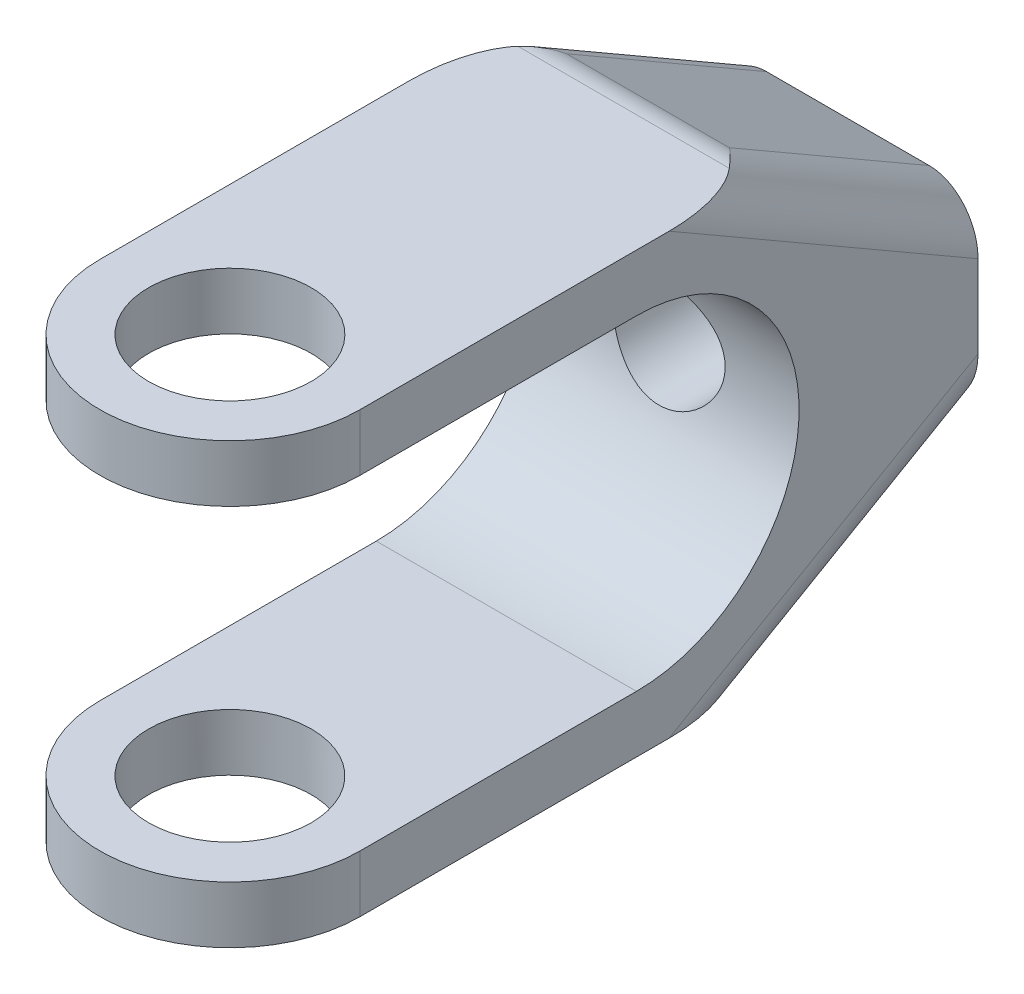
ISO-10303-21;
HEADER;
FILE_DESCRIPTION(('STEP AP214'),'2;1');
FILE_NAME('part.step','',(''),(''),'','','');
FILE_SCHEMA(('AUTOMOTIVE_DESIGN { 1 0 10303 214 1 1 1 1 }'));
ENDSEC;
DATA;
#1=APPLICATION_CONTEXT('core data for automotive mechanical design processes');
#2=APPLICATION_PROTOCOL_DEFINITION('international standard','automotive_design',2000,#1);
#3=PRODUCT_CONTEXT('',#1,'mechanical');
#4=PRODUCT('Part','Part','',(#3));
#5=PRODUCT_RELATED_PRODUCT_CATEGORY('part','',(#4));
#6=PRODUCT_DEFINITION_FORMATION('','',#4);
#7=PRODUCT_DEFINITION_CONTEXT('part definition',#1,'design');
#8=PRODUCT_DEFINITION('design','',#6,#7);
#9=PRODUCT_DEFINITION_SHAPE('','',#8);
#10=(LENGTH_UNIT() NAMED_UNIT(*) SI_UNIT(.MILLI.,.METRE.));
#11=(NAMED_UNIT(*) PLANE_ANGLE_UNIT() SI_UNIT($,.RADIAN.));
#12=(NAMED_UNIT(*) SI_UNIT($,.STERADIAN.) SOLID_ANGLE_UNIT());
#13=UNCERTAINTY_MEASURE_WITH_UNIT(LENGTH_MEASURE(1.E-05),#10,'distance_accuracy_value','');
#14=(GEOMETRIC_REPRESENTATION_CONTEXT(3) GLOBAL_UNCERTAINTY_ASSIGNED_CONTEXT((#13)) GLOBAL_UNIT_ASSIGNED_CONTEXT((#10,
#11,#12)) REPRESENTATION_CONTEXT('',''));
#15=CARTESIAN_POINT('',(0.,0.,0.));
#16=DIRECTION('',(0.,0.,1.));
#17=DIRECTION('',(1.,0.,0.));
#18=AXIS2_PLACEMENT_3D('',#15,#16,#17);
#19=CARTESIAN_POINT('',(-11.,13.5,60.));
#20=DIRECTION('',(0.,-1.,0.));
#21=DIRECTION('',(0.,0.,-1.));
#22=AXIS2_PLACEMENT_3D('',#19,#20,#21);
#23=PLANE('',#22);
#24=CARTESIAN_POINT('',(0.,13.5,38.));
#25=DIRECTION('',(0.,1.,0.));
#26=DIRECTION('',(0.,0.,1.));
#27=AXIS2_PLACEMENT_3D('',#24,#25,#26);
#28=CIRCLE('',#27,5.);
#29=CARTESIAN_POINT('',(0.,13.5,43.));
#30=VERTEX_POINT('',#29);
#31=EDGE_CURVE('E209',#30,#30,#28,.T.);
#32=ORIENTED_EDGE('',*,*,#31,.F.);
#33=EDGE_LOOP('',(#32));
#34=FACE_BOUND('',#33,.T.);
#35=DIRECTION('',(-1.,0.,0.));
#36=VECTOR('',#35,1.);
#37=CARTESIAN_POINT('',(-11.,13.5,13.7942286340599));
#38=LINE('',#37,#36);
#39=CARTESIAN_POINT('',(6.50000000000001,13.5,13.7942286340599));
#40=VERTEX_POINT('',#39);
#41=CARTESIAN_POINT('',(-6.5,13.5,13.7942286340599));
#42=VERTEX_POINT('',#41);
#43=EDGE_CURVE('E55',#40,#42,#38,.T.);
#44=ORIENTED_EDGE('',*,*,#43,.T.);
#45=CARTESIAN_POINT('',(-5.,13.5,18.9903810567665));
#46=DIRECTION('',(0.,-1.,0.));
#47=DIRECTION('',(0.,0.,-1.));
#48=AXIS2_PLACEMENT_3D('',#45,#46,#47);
#49=ELLIPSE('',#48,5.99999999999999,3.);
#50=CARTESIAN_POINT('',(-8.,13.5,18.9903810567665));
#51=VERTEX_POINT('',#50);
#52=EDGE_CURVE('E11',#42,#51,#49,.F.);
#53=ORIENTED_EDGE('',*,*,#52,.T.);
#54=DIRECTION('',(0.,0.,-1.));
#55=VECTOR('',#54,1.);
#56=CARTESIAN_POINT('',(-8.,13.5,38.));
#57=LINE('',#56,#55);
#58=CARTESIAN_POINT('',(-8.,13.5,38.));
#59=VERTEX_POINT('',#58);
#60=EDGE_CURVE('E158',#59,#51,#57,.T.);
#61=ORIENTED_EDGE('',*,*,#60,.F.);
#62=CARTESIAN_POINT('',(0.,13.5,38.));
#63=DIRECTION('',(0.,-1.,0.));
#64=DIRECTION('',(0.,0.,1.));
#65=AXIS2_PLACEMENT_3D('',#62,#63,#64);
#66=CIRCLE('',#65,8.);
#67=CARTESIAN_POINT('',(8.,13.5,38.));
#68=VERTEX_POINT('',#67);
#69=EDGE_CURVE('E169',#68,#59,#66,.T.);
#70=ORIENTED_EDGE('',*,*,#69,.F.);
#71=DIRECTION('',(0.,0.,1.));
#72=VECTOR('',#71,1.);
#73=CARTESIAN_POINT('',(8.,13.5,38.));
#74=LINE('',#73,#72);
#75=CARTESIAN_POINT('',(8.,13.5,18.9903810567665));
#76=VERTEX_POINT('',#75);
#77=EDGE_CURVE('E176',#76,#68,#74,.T.);
#78=ORIENTED_EDGE('',*,*,#77,.F.);
#79=CARTESIAN_POINT('',(5.,13.5,18.9903810567665));
#80=DIRECTION('',(0.,-1.,0.));
#81=DIRECTION('',(0.,0.,-1.));
#82=AXIS2_PLACEMENT_3D('',#79,#80,#81);
#83=ELLIPSE('',#82,5.99999999999999,3.);
#84=EDGE_CURVE('E48',#76,#40,#83,.F.);
#85=ORIENTED_EDGE('',*,*,#84,.T.);
#86=EDGE_LOOP('',(#44,#53,#61,#70,#78,#85));
#87=FACE_BOUND('',#86,.T.);
#88=ADVANCED_FACE('F39',(#34,#87),#23,.F.);
#89=CARTESIAN_POINT('',(-11.,-13.5,60.));
#90=DIRECTION('',(0.,1.,0.));
#91=DIRECTION('',(0.,0.,1.));
#92=AXIS2_PLACEMENT_3D('',#89,#90,#91);
#93=PLANE('',#92);
#94=DIRECTION('',(0.,0.,-1.));
#95=VECTOR('',#94,1.);
#96=CARTESIAN_POINT('',(-8.,-13.5,38.));
#97=LINE('',#96,#95);
#98=CARTESIAN_POINT('',(-8.,-13.5,38.));
#99=VERTEX_POINT('',#98);
#100=CARTESIAN_POINT('',(-8.,-13.5,18.9903810567665));
#101=VERTEX_POINT('',#100);
#102=EDGE_CURVE('E184',#99,#101,#97,.T.);
#103=ORIENTED_EDGE('',*,*,#102,.T.);
#104=CARTESIAN_POINT('',(-5.,-13.5,18.9903810567665));
#105=DIRECTION('',(0.,1.,0.));
#106=DIRECTION('',(0.,0.,1.));
#107=AXIS2_PLACEMENT_3D('',#104,#105,#106);
#108=ELLIPSE('',#107,5.99999999999999,3.);
#109=CARTESIAN_POINT('',(-6.50000000000001,-13.5,13.7942286340599));
#110=VERTEX_POINT('',#109);
#111=EDGE_CURVE('E358',#101,#110,#108,.F.);
#112=ORIENTED_EDGE('',*,*,#111,.T.);
#113=DIRECTION('',(1.,0.,0.));
#114=VECTOR('',#113,1.);
#115=CARTESIAN_POINT('',(-11.,-13.5,13.7942286340599));
#116=LINE('',#115,#114);
#117=CARTESIAN_POINT('',(6.50000000000001,-13.5,13.7942286340599));
#118=VERTEX_POINT('',#117);
#119=EDGE_CURVE('E362',#110,#118,#116,.T.);
#120=ORIENTED_EDGE('',*,*,#119,.T.);
#121=CARTESIAN_POINT('',(5.,-13.5,18.9903810567665));
#122=DIRECTION('',(0.,1.,0.));
#123=DIRECTION('',(0.,0.,1.));
#124=AXIS2_PLACEMENT_3D('',#121,#122,#123);
#125=ELLIPSE('',#124,5.99999999999999,3.);
#126=CARTESIAN_POINT('',(8.,-13.5,18.9903810567665));
#127=VERTEX_POINT('',#126);
#128=EDGE_CURVE('E360',#118,#127,#125,.F.);
#129=ORIENTED_EDGE('',*,*,#128,.T.);
#130=DIRECTION('',(0.,0.,1.));
#131=VECTOR('',#130,1.);
#132=CARTESIAN_POINT('',(8.,-13.5,38.));
#133=LINE('',#132,#131);
#134=CARTESIAN_POINT('',(8.,-13.5,38.));
#135=VERTEX_POINT('',#134);
#136=EDGE_CURVE('E165',#127,#135,#133,.T.);
#137=ORIENTED_EDGE('',*,*,#136,.T.);
#138=CARTESIAN_POINT('',(0.,-13.5,38.));
#139=DIRECTION('',(0.,-1.,0.));
#140=DIRECTION('',(0.,0.,1.));
#141=AXIS2_PLACEMENT_3D('',#138,#139,#140);
#142=CIRCLE('',#141,8.);
#143=EDGE_CURVE('E178',#135,#99,#142,.T.);
#144=ORIENTED_EDGE('',*,*,#143,.T.);
#145=EDGE_LOOP('',(#103,#112,#120,#129,#137,#144));
#146=FACE_BOUND('',#145,.T.);
#147=CARTESIAN_POINT('',(0.,-13.5,38.));
#148=DIRECTION('',(0.,1.,0.));
#149=DIRECTION('',(0.,0.,1.));
#150=AXIS2_PLACEMENT_3D('',#147,#148,#149);
#151=CIRCLE('',#150,5.);
#152=CARTESIAN_POINT('',(0.,-13.5,43.));
#153=VERTEX_POINT('',#152);
#154=EDGE_CURVE('E212',#153,#153,#151,.T.);
#155=ORIENTED_EDGE('',*,*,#154,.T.);
#156=EDGE_LOOP('',(#155));
#157=FACE_BOUND('',#156,.T.);
#158=ADVANCED_FACE('F282',(#146,#157),#93,.F.);
#159=CARTESIAN_POINT('',(11.,13.5,0.));
#160=DIRECTION('',(0.,0.,-1.));
#161=DIRECTION('',(-1.,0.,0.));
#162=AXIS2_PLACEMENT_3D('',#159,#160,#161);
#163=PLANE('',#162);
#164=DIRECTION('',(1.,0.,0.));
#165=VECTOR('',#164,1.);
#166=CARTESIAN_POINT('',(-8.,-6.,0.));
#167=LINE('',#166,#165);
#168=CARTESIAN_POINT('',(-5.,-6.,0.));
#169=VERTEX_POINT('',#168);
#170=CARTESIAN_POINT('',(5.,-6.,0.));
#171=VERTEX_POINT('',#170);
#172=EDGE_CURVE('E374',#169,#171,#167,.T.);
#173=ORIENTED_EDGE('',*,*,#172,.F.);
#174=CARTESIAN_POINT('',(-5.,-2.53589838486224,0.));
#175=DIRECTION('',(0.,0.,-1.));
#176=DIRECTION('',(0.,-1.,0.));
#177=AXIS2_PLACEMENT_3D('',#174,#175,#176);
#178=ELLIPSE('',#177,3.46410161513776,3.);
#179=CARTESIAN_POINT('',(-8.,-2.53589838486224,0.));
#180=VERTEX_POINT('',#179);
#181=EDGE_CURVE('E344',#169,#180,#178,.T.);
#182=ORIENTED_EDGE('',*,*,#181,.T.);
#183=DIRECTION('',(0.,-1.,0.));
#184=VECTOR('',#183,1.);
#185=CARTESIAN_POINT('',(-8.,13.5,0.));
#186=LINE('',#185,#184);
#187=CARTESIAN_POINT('',(-8.,2.53589838486224,0.));
#188=VERTEX_POINT('',#187);
#189=EDGE_CURVE('E196',#188,#180,#186,.T.);
#190=ORIENTED_EDGE('',*,*,#189,.F.);
#191=CARTESIAN_POINT('',(-5.,2.53589838486224,0.));
#192=DIRECTION('',(0.,0.,-1.));
#193=DIRECTION('',(0.,-1.,0.));
#194=AXIS2_PLACEMENT_3D('',#191,#192,#193);
#195=ELLIPSE('',#194,3.46410161513776,3.);
#196=CARTESIAN_POINT('',(-5.,6.,0.));
#197=VERTEX_POINT('',#196);
#198=EDGE_CURVE('E348',#188,#197,#195,.T.);
#199=ORIENTED_EDGE('',*,*,#198,.T.);
#200=DIRECTION('',(1.,0.,0.));
#201=VECTOR('',#200,1.);
#202=CARTESIAN_POINT('',(-8.,6.,0.));
#203=LINE('',#202,#201);
#204=CARTESIAN_POINT('',(5.,6.,0.));
#205=VERTEX_POINT('',#204);
#206=EDGE_CURVE('E331',#197,#205,#203,.T.);
#207=ORIENTED_EDGE('',*,*,#206,.T.);
#208=CARTESIAN_POINT('',(5.,2.53589838486224,0.));
#209=DIRECTION('',(0.,0.,-1.));
#210=DIRECTION('',(0.,-1.,0.));
#211=AXIS2_PLACEMENT_3D('',#208,#209,#210);
#212=ELLIPSE('',#211,3.46410161513776,3.);
#213=CARTESIAN_POINT('',(8.,2.53589838486224,0.));
#214=VERTEX_POINT('',#213);
#215=EDGE_CURVE('E350',#205,#214,#212,.T.);
#216=ORIENTED_EDGE('',*,*,#215,.T.);
#217=DIRECTION('',(0.,1.,0.));
#218=VECTOR('',#217,1.);
#219=CARTESIAN_POINT('',(8.,13.5,0.));
#220=LINE('',#219,#218);
#221=CARTESIAN_POINT('',(8.,-2.53589838486224,0.));
#222=VERTEX_POINT('',#221);
#223=EDGE_CURVE('E204',#222,#214,#220,.T.);
#224=ORIENTED_EDGE('',*,*,#223,.F.);
#225=CARTESIAN_POINT('',(5.,-2.53589838486224,0.));
#226=DIRECTION('',(0.,0.,-1.));
#227=DIRECTION('',(0.,-1.,0.));
#228=AXIS2_PLACEMENT_3D('',#225,#226,#227);
#229=ELLIPSE('',#228,3.46410161513776,3.);
#230=EDGE_CURVE('E346',#222,#171,#229,.T.);
#231=ORIENTED_EDGE('',*,*,#230,.T.);
#232=EDGE_LOOP('',(#173,#182,#190,#199,#207,#216,#224,#231));
#233=FACE_BOUND('',#232,.T.);
#234=CARTESIAN_POINT('',(0.,0.,0.));
#235=DIRECTION('',(0.,0.,-1.));
#236=DIRECTION('',(-1.,0.,0.));
#237=AXIS2_PLACEMENT_3D('',#234,#235,#236);
#238=CIRCLE('',#237,3.45439999999999);
#239=CARTESIAN_POINT('',(-3.45439999999999,0.,0.));
#240=VERTEX_POINT('',#239);
#241=EDGE_CURVE('E244',#240,#240,#238,.T.);
#242=ORIENTED_EDGE('',*,*,#241,.F.);
#243=EDGE_LOOP('',(#242));
#244=FACE_BOUND('',#243,.T.);
#245=ADVANCED_FACE('F275',(#233,#244),#163,.T.);
#246=CARTESIAN_POINT('',(-11.,9.99999999999999,66.9109187860093));
#247=DIRECTION('',(0.,1.,0.));
#248=DIRECTION('',(0.,0.,1.));
#249=AXIS2_PLACEMENT_3D('',#246,#247,#248);
#250=PLANE('',#249);
#251=CARTESIAN_POINT('',(0.,10.,38.));
#252=DIRECTION('',(0.,1.,0.));
#253=DIRECTION('',(0.,0.,1.));
#254=AXIS2_PLACEMENT_3D('',#251,#252,#253);
#255=CIRCLE('',#254,5.);
#256=CARTESIAN_POINT('',(0.,10.,43.));
#257=VERTEX_POINT('',#256);
#258=EDGE_CURVE('E216',#257,#257,#255,.T.);
#259=ORIENTED_EDGE('',*,*,#258,.T.);
#260=EDGE_LOOP('',(#259));
#261=FACE_BOUND('',#260,.T.);
#262=DIRECTION('',(1.,0.,0.));
#263=VECTOR('',#262,1.);
#264=CARTESIAN_POINT('',(-11.,10.,21.));
#265=LINE('',#264,#263);
#266=CARTESIAN_POINT('',(-8.,10.,21.));
#267=VERTEX_POINT('',#266);
#268=CARTESIAN_POINT('',(8.,10.,21.));
#269=VERTEX_POINT('',#268);
#270=EDGE_CURVE('E220',#267,#269,#265,.T.);
#271=ORIENTED_EDGE('',*,*,#270,.T.);
#272=DIRECTION('',(0.,0.,1.));
#273=VECTOR('',#272,1.);
#274=CARTESIAN_POINT('',(8.,9.99999999999999,66.9109187860093));
#275=LINE('',#274,#273);
#276=CARTESIAN_POINT('',(8.,10.,38.));
#277=VERTEX_POINT('',#276);
#278=EDGE_CURVE('E201',#269,#277,#275,.T.);
#279=ORIENTED_EDGE('',*,*,#278,.T.);
#280=CARTESIAN_POINT('',(0.,10.,38.));
#281=DIRECTION('',(0.,1.,0.));
#282=DIRECTION('',(0.,0.,1.));
#283=AXIS2_PLACEMENT_3D('',#280,#281,#282);
#284=CIRCLE('',#283,8.);
#285=CARTESIAN_POINT('',(-8.,10.,38.));
#286=VERTEX_POINT('',#285);
#287=EDGE_CURVE('E207',#277,#286,#284,.F.);
#288=ORIENTED_EDGE('',*,*,#287,.T.);
#289=DIRECTION('',(0.,0.,-1.));
#290=VECTOR('',#289,1.);
#291=CARTESIAN_POINT('',(-8.,9.99999999999999,66.9109187860093));
#292=LINE('',#291,#290);
#293=EDGE_CURVE('E161',#286,#267,#292,.T.);
#294=ORIENTED_EDGE('',*,*,#293,.T.);
#295=EDGE_LOOP('',(#271,#279,#288,#294));
#296=FACE_BOUND('',#295,.T.);
#297=ADVANCED_FACE('F272',(#261,#296),#250,.F.);
#298=CARTESIAN_POINT('',(-11.,-10.,66.9109187860093));
#299=DIRECTION('',(0.,-1.,0.));
#300=DIRECTION('',(0.,0.,-1.));
#301=AXIS2_PLACEMENT_3D('',#298,#299,#300);
#302=PLANE('',#301);
#303=CARTESIAN_POINT('',(0.,-10.,38.));
#304=DIRECTION('',(0.,-1.,0.));
#305=DIRECTION('',(0.,0.,-1.));
#306=AXIS2_PLACEMENT_3D('',#303,#304,#305);
#307=CIRCLE('',#306,5.);
#308=CARTESIAN_POINT('',(0.,-10.,33.));
#309=VERTEX_POINT('',#308);
#310=EDGE_CURVE('E215',#309,#309,#307,.T.);
#311=ORIENTED_EDGE('',*,*,#310,.T.);
#312=EDGE_LOOP('',(#311));
#313=FACE_BOUND('',#312,.T.);
#314=CARTESIAN_POINT('',(0.,-10.,38.));
#315=DIRECTION('',(0.,-1.,0.));
#316=DIRECTION('',(0.,0.,-1.));
#317=AXIS2_PLACEMENT_3D('',#314,#315,#316);
#318=CIRCLE('',#317,8.);
#319=CARTESIAN_POINT('',(-8.,-10.,38.));
#320=VERTEX_POINT('',#319);
#321=CARTESIAN_POINT('',(8.,-10.,38.));
#322=VERTEX_POINT('',#321);
#323=EDGE_CURVE('E233',#320,#322,#318,.F.);
#324=ORIENTED_EDGE('',*,*,#323,.T.);
#325=DIRECTION('',(0.,0.,-1.));
#326=VECTOR('',#325,1.);
#327=CARTESIAN_POINT('',(8.,-10.,66.9109187860093));
#328=LINE('',#327,#326);
#329=CARTESIAN_POINT('',(8.,-10.,21.));
#330=VERTEX_POINT('',#329);
#331=EDGE_CURVE('E198',#322,#330,#328,.T.);
#332=ORIENTED_EDGE('',*,*,#331,.T.);
#333=DIRECTION('',(1.,0.,0.));
#334=VECTOR('',#333,1.);
#335=CARTESIAN_POINT('',(-11.,-10.,21.));
#336=LINE('',#335,#334);
#337=CARTESIAN_POINT('',(-8.,-10.,21.));
#338=VERTEX_POINT('',#337);
#339=EDGE_CURVE('E219',#338,#330,#336,.T.);
#340=ORIENTED_EDGE('',*,*,#339,.F.);
#341=DIRECTION('',(0.,0.,1.));
#342=VECTOR('',#341,1.);
#343=CARTESIAN_POINT('',(-8.,-10.,66.9109187860093));
#344=LINE('',#343,#342);
#345=EDGE_CURVE('E190',#338,#320,#344,.T.);
#346=ORIENTED_EDGE('',*,*,#345,.T.);
#347=EDGE_LOOP('',(#324,#332,#340,#346));
#348=FACE_BOUND('',#347,.T.);
#349=ADVANCED_FACE('F274',(#313,#348),#302,.F.);
#350=CARTESIAN_POINT('',(-11.,0.,21.));
#351=DIRECTION('',(1.,0.,0.));
#352=DIRECTION('',(0.,0.,-1.));
#353=AXIS2_PLACEMENT_3D('',#350,#351,#352);
#354=CYLINDRICAL_SURFACE('',#353,10.);
#355=CARTESIAN_POINT('',(-3.45439999999999,0.,11.));
#356=CARTESIAN_POINT('',(-3.45440232531025,0.188089881730273,10.9999984011474));
#357=CARTESIAN_POINT('',(-3.43898844177707,0.376163267515252,11.0053548594497));
#358=CARTESIAN_POINT('',(-3.37794561657358,0.74674700698395,11.0261932095916));
#359=CARTESIAN_POINT('',(-3.33231571735188,0.92925718417677,11.0416754223182));
#360=CARTESIAN_POINT('',(-3.2126079762716,1.28331854023954,11.081088637189));
#361=CARTESIAN_POINT('',(-3.13857977933761,1.4548882378532,11.1050048893796));
#362=CARTESIAN_POINT('',(-2.96440913257944,1.7831734956332,11.1588618462222));
#363=CARTESIAN_POINT('',(-2.86426095645228,1.93988578831445,11.1888038715799));
#364=CARTESIAN_POINT('',(-2.63682115486224,2.23978536206107,11.252812361631));
#365=CARTESIAN_POINT('',(-2.50873802609608,2.3823500276112,11.2869828302871));
#366=CARTESIAN_POINT('',(-2.23074591593128,2.64445904069319,11.3550423115595));
#367=CARTESIAN_POINT('',(-2.08083165503231,2.76399780350051,11.3889312539919));
#368=CARTESIAN_POINT('',(-1.75769500170555,2.98032682021001,11.4537529412492));
#369=CARTESIAN_POINT('',(-1.58389009504216,3.07628828388773,11.4845600150523));
#370=CARTESIAN_POINT('',(-1.22137303376185,3.23734903859446,11.5381381804504));
#371=CARTESIAN_POINT('',(-1.03266583910756,3.30245854806389,11.5609119321134));
#372=CARTESIAN_POINT('',(-0.652809235731304,3.39759686873007,11.5947451798316));
#373=CARTESIAN_POINT('',(-0.461989511401757,3.4287988814145,11.6061951102357));
#374=CARTESIAN_POINT('',(-0.0775059747755963,3.4589048054868,11.6172360364144));
#375=CARTESIAN_POINT('',(0.116156858291762,3.45781958802336,11.6168310237631));
#376=CARTESIAN_POINT('',(0.490629577612981,3.42428882179926,11.6045484535272));
#377=CARTESIAN_POINT('',(0.671600829228169,3.39339992468503,11.5932403852256));
#378=CARTESIAN_POINT('',(1.02561367938766,3.30368752839996,11.5613617776443));
#379=CARTESIAN_POINT('',(1.1986542591571,3.24486045125517,11.5407900520083));
#380=CARTESIAN_POINT('',(1.53532743180596,3.09996984019719,11.4923143383717));
#381=CARTESIAN_POINT('',(1.69875079969756,3.01346147577301,11.4642919594511));
#382=CARTESIAN_POINT('',(2.00924220534595,2.81597291597924,11.4041191190733));
#383=CARTESIAN_POINT('',(2.15630522419957,2.70498524200678,11.3719673973291));
#384=CARTESIAN_POINT('',(2.43861375869703,2.4543114976245,11.3049452762759));
#385=CARTESIAN_POINT('',(2.57272672671206,2.31336088882338,11.270023760702));
#386=CARTESIAN_POINT('',(2.81571910947767,2.01054578348996,11.2029736254065));
#387=CARTESIAN_POINT('',(2.92459573252129,1.84867897623781,11.1708453149216));
#388=CARTESIAN_POINT('',(3.11502773874928,1.50608930571174,11.1125238208085));
#389=CARTESIAN_POINT('',(3.19625922162735,1.32517339118463,11.0864020901663));
#390=CARTESIAN_POINT('',(3.32677618530571,0.951123282427877,11.0435583146406));
#391=CARTESIAN_POINT('',(3.37607362106291,0.757993690313941,11.0268327524817));
#392=CARTESIAN_POINT('',(3.43926926960261,0.37457075921164,11.0052585215803));
#393=CARTESIAN_POINT('',(3.45469629539973,0.184557923842957,10.9998973119141));
#394=CARTESIAN_POINT('',(3.45409521008105,-0.19539209379586,11.0001056223695));
#395=CARTESIAN_POINT('',(3.43807285755453,-0.385329283547716,11.0056731413687));
#396=CARTESIAN_POINT('',(3.37622541974519,-0.753481872537956,11.0267746503592));
#397=CARTESIAN_POINT('',(3.3313562646545,-0.931878032813955,11.0419887549521));
#398=CARTESIAN_POINT('',(3.21430169002995,-1.27852450605863,11.0805335220875));
#399=CARTESIAN_POINT('',(3.14211274673749,-1.44677350698035,11.1038652316229));
#400=CARTESIAN_POINT('',(2.97029349778352,-1.7734799642723,11.1570874587619));
#401=CARTESIAN_POINT('',(2.86996745884375,-1.93154440556766,11.187139729693));
#402=CARTESIAN_POINT('',(2.64552977636169,-2.22908147317249,11.2504168563703));
#403=CARTESIAN_POINT('',(2.5214104059583,-2.36854803482207,11.283642740981));
#404=CARTESIAN_POINT('',(2.24573013346958,-2.63204899129594,11.3515935465224));
#405=CARTESIAN_POINT('',(2.09312303633791,-2.75499316831401,11.3863121942313));
#406=CARTESIAN_POINT('',(1.76871123740046,-2.97368499352199,11.4516877399922));
#407=CARTESIAN_POINT('',(1.59690601644061,-3.06943190599762,11.4823445281546));
#408=CARTESIAN_POINT('',(1.23858063935498,-3.23068975158709,11.5358624308666));
#409=CARTESIAN_POINT('',(1.05206928663285,-3.29621861535613,11.5587281663285));
#410=CARTESIAN_POINT('',(0.669674924670504,-3.39460452922841,11.5936490235172));
#411=CARTESIAN_POINT('',(0.473796608381322,-3.42747776407856,11.6057095002433));
#412=CARTESIAN_POINT('',(0.0898353402698083,-3.4583013188206,11.6170157054289));
#413=CARTESIAN_POINT('',(-0.0980830810988358,-3.45807464900595,11.6169303828014));
#414=CARTESIAN_POINT('',(-0.471052269044782,-3.42724323719346,11.6056257654167));
#415=CARTESIAN_POINT('',(-0.656103230516847,-3.39664056906297,11.5944072307598));
#416=CARTESIAN_POINT('',(-1.01402051304064,-3.30725530133773,11.5626157455072));
#417=CARTESIAN_POINT('',(-1.1870650480889,-3.24910540847066,11.5422533336082));
#418=CARTESIAN_POINT('',(-1.52106769397116,-3.10680007384281,11.4945595527697));
#419=CARTESIAN_POINT('',(-1.68202299233134,-3.02263860382606,11.4672265686375));
#420=CARTESIAN_POINT('',(-1.99535231364582,-2.82616453598413,11.4070964352813));
#421=CARTESIAN_POINT('',(-2.14698533771132,-2.71273013008785,11.37410505772));
#422=CARTESIAN_POINT('',(-2.4296513987649,-2.46278082365563,11.3071453358633));
#423=CARTESIAN_POINT('',(-2.56067838831831,-2.32625917180707,11.2731767082127));
#424=CARTESIAN_POINT('',(-2.80411467587727,-2.02696690908732,11.2063350606043));
#425=CARTESIAN_POINT('',(-2.91548053305727,-1.86331972489759,11.1735720419246));
#426=CARTESIAN_POINT('',(-3.10902331815379,-1.51852456389522,11.1144232597185));
#427=CARTESIAN_POINT('',(-3.19120513261142,-1.3373795233698,11.0880364288076));
#428=CARTESIAN_POINT('',(-3.32216299473923,-0.966436824441348,11.0450955246769));
#429=CARTESIAN_POINT('',(-3.37158275573099,-0.7768891655691,11.028352882651));
#430=CARTESIAN_POINT('',(-3.4376946522457,-0.391553661485798,11.0058077561295));
#431=CARTESIAN_POINT('',(-3.45439757976827,-0.195767895645514,11.0000016641194));
#432=CARTESIAN_POINT('',(-3.45439999999999,0.,11.));
#433=B_SPLINE_CURVE_WITH_KNOTS('',3,(#355,#356,#357,#358,#359,#360,#361,#362,#363,#364,#365,
#366,#367,#368,#369,#370,#371,#372,#373,#374,#375,#376,#377,#378,#379,#380,#381,#382,#383,#384,
#385,#386,#387,#388,#389,#390,#391,#392,#393,#394,#395,#396,#397,#398,#399,#400,#401,#402,#403,
#404,#405,#406,#407,#408,#409,#410,#411,#412,#413,#414,#415,#416,#417,#418,#419,#420,#421,#422,
#423,#424,#425,#426,#427,#428,#429,#430,#431,#432),.UNSPECIFIED.,.T.,.F.,(4,2,2,2,2,2,2,2,2,2,2,
2,2,2,2,2,2,2,2,2,2,2,2,2,2,2,2,2,2,2,2,2,2,2,2,2,2,2,4),(0.,0.56354874017713,1.12711534017791,
1.68970118939144,2.25241047855434,2.83382171191008,3.41537378423257,4.0151217218903,
4.61467087863339,5.19274120634123,5.77061689928728,6.31985733107255,6.86916812170357,
7.42779133483943,7.98658544831227,8.57686089445485,9.16720160719812,9.76423829741424,
10.3610513492329,10.9303188928335,11.4994822095039,12.0506938672869,12.6019766456497,
13.1683184944026,13.7348445746464,14.3291145137126,14.9234005268678,15.5173334499583,
16.1109718615817,16.6719280845273,17.232846011817,17.7814629472956,18.3302071217473,
18.9043265395641,19.4786141361001,20.07760784273,20.6765012072301,21.2632481385067,
21.8498014923781),.UNSPECIFIED.);
#434=CARTESIAN_POINT('',(-3.45439999999999,0.,11.));
#435=VERTEX_POINT('',#434);
#436=EDGE_CURVE('E173',#435,#435,#433,.T.);
#437=ORIENTED_EDGE('',*,*,#436,.T.);
#438=EDGE_LOOP('',(#437));
#439=FACE_BOUND('',#438,.T.);
#440=ORIENTED_EDGE('',*,*,#339,.T.);
#441=CARTESIAN_POINT('',(8.,0.,21.));
#442=DIRECTION('',(-1.,0.,0.));
#443=DIRECTION('',(0.,0.,1.));
#444=AXIS2_PLACEMENT_3D('',#441,#442,#443);
#445=CIRCLE('',#444,10.);
#446=EDGE_CURVE('E230',#330,#269,#445,.F.);
#447=ORIENTED_EDGE('',*,*,#446,.T.);
#448=ORIENTED_EDGE('',*,*,#270,.F.);
#449=CARTESIAN_POINT('',(-8.,0.,21.));
#450=DIRECTION('',(1.,0.,0.));
#451=DIRECTION('',(0.,0.,-1.));
#452=AXIS2_PLACEMENT_3D('',#449,#450,#451);
#453=CIRCLE('',#452,10.);
#454=EDGE_CURVE('E223',#267,#338,#453,.F.);
#455=ORIENTED_EDGE('',*,*,#454,.T.);
#456=EDGE_LOOP('',(#440,#447,#448,#455));
#457=FACE_BOUND('',#456,.T.);
#458=ADVANCED_FACE('F246',(#439,#457),#354,.F.);
#459=CARTESIAN_POINT('',(0.,-13.5,38.));
#460=DIRECTION('',(0.,1.,0.));
#461=DIRECTION('',(0.,0.,1.));
#462=AXIS2_PLACEMENT_3D('',#459,#460,#461);
#463=CYLINDRICAL_SURFACE('',#462,5.);
#464=ORIENTED_EDGE('',*,*,#154,.F.);
#465=EDGE_LOOP('',(#464));
#466=FACE_BOUND('',#465,.T.);
#467=ORIENTED_EDGE('',*,*,#310,.F.);
#468=EDGE_LOOP('',(#467));
#469=FACE_BOUND('',#468,.T.);
#470=ADVANCED_FACE('F270',(#466,#469),#463,.F.);
#471=ORIENTED_EDGE('',*,*,#31,.T.);
#472=EDGE_LOOP('',(#471));
#473=FACE_BOUND('',#472,.T.);
#474=ORIENTED_EDGE('',*,*,#258,.F.);
#475=EDGE_LOOP('',(#474));
#476=FACE_BOUND('',#475,.T.);
#477=ADVANCED_FACE('F268',(#473,#476),#463,.F.);
#478=CARTESIAN_POINT('',(0.,-13.5,38.));
#479=DIRECTION('',(0.,1.,0.));
#480=DIRECTION('',(0.,0.,1.));
#481=AXIS2_PLACEMENT_3D('',#478,#479,#480);
#482=CYLINDRICAL_SURFACE('',#481,8.);
#483=DIRECTION('',(0.,1.,0.));
#484=VECTOR('',#483,1.);
#485=CARTESIAN_POINT('',(8.,-13.5,38.));
#486=LINE('',#485,#484);
#487=EDGE_CURVE('E172',#277,#68,#486,.T.);
#488=ORIENTED_EDGE('',*,*,#487,.T.);
#489=ORIENTED_EDGE('',*,*,#69,.T.);
#490=DIRECTION('',(0.,1.,0.));
#491=VECTOR('',#490,1.);
#492=CARTESIAN_POINT('',(-8.,-13.5,38.));
#493=LINE('',#492,#491);
#494=EDGE_CURVE('E152',#286,#59,#493,.T.);
#495=ORIENTED_EDGE('',*,*,#494,.F.);
#496=ORIENTED_EDGE('',*,*,#287,.F.);
#497=EDGE_LOOP('',(#488,#489,#495,#496));
#498=FACE_BOUND('',#497,.T.);
#499=ADVANCED_FACE('F170',(#498),#482,.T.);
#500=EDGE_CURVE('E164',#99,#320,#493,.T.);
#501=ORIENTED_EDGE('',*,*,#500,.F.);
#502=ORIENTED_EDGE('',*,*,#143,.F.);
#503=EDGE_CURVE('E188',#135,#322,#486,.T.);
#504=ORIENTED_EDGE('',*,*,#503,.T.);
#505=ORIENTED_EDGE('',*,*,#323,.F.);
#506=EDGE_LOOP('',(#501,#502,#504,#505));
#507=FACE_BOUND('',#506,.T.);
#508=ADVANCED_FACE('F262',(#507),#482,.T.);
#509=CARTESIAN_POINT('',(8.,-13.5,38.));
#510=DIRECTION('',(-1.,0.,0.));
#511=DIRECTION('',(0.,0.,1.));
#512=AXIS2_PLACEMENT_3D('',#509,#510,#511);
#513=PLANE('',#512);
#514=ORIENTED_EDGE('',*,*,#136,.F.);
#515=DIRECTION('',(0.,-0.500000000000001,0.866025403784438));
#516=VECTOR('',#515,1.);
#517=CARTESIAN_POINT('',(8.,-21.7314064605511,33.2475952641916));
#518=LINE('',#517,#516);
#519=EDGE_CURVE('E340',#127,#222,#518,.F.);
#520=ORIENTED_EDGE('',*,*,#519,.T.);
#521=ORIENTED_EDGE('',*,*,#223,.T.);
#522=DIRECTION('',(0.,-0.500000000000001,-0.866025403784438));
#523=VECTOR('',#522,1.);
#524=CARTESIAN_POINT('',(8.,14.981406460551,21.5562523131017));
#525=LINE('',#524,#523);
#526=EDGE_CURVE('E342',#214,#76,#525,.F.);
#527=ORIENTED_EDGE('',*,*,#526,.T.);
#528=ORIENTED_EDGE('',*,*,#77,.T.);
#529=ORIENTED_EDGE('',*,*,#487,.F.);
#530=ORIENTED_EDGE('',*,*,#278,.F.);
#531=ORIENTED_EDGE('',*,*,#446,.F.);
#532=ORIENTED_EDGE('',*,*,#331,.F.);
#533=ORIENTED_EDGE('',*,*,#503,.F.);
#534=EDGE_LOOP('',(#514,#520,#521,#527,#528,#529,#530,#531,#532,#533));
#535=FACE_BOUND('',#534,.T.);
#536=ADVANCED_FACE('F259',(#535),#513,.F.);
#537=CARTESIAN_POINT('',(-8.,-13.5,38.));
#538=DIRECTION('',(1.,0.,0.));
#539=DIRECTION('',(0.,0.,-1.));
#540=AXIS2_PLACEMENT_3D('',#537,#538,#539);
#541=PLANE('',#540);
#542=ORIENTED_EDGE('',*,*,#189,.T.);
#543=DIRECTION('',(0.,-0.500000000000001,0.866025403784438));
#544=VECTOR('',#543,1.);
#545=CARTESIAN_POINT('',(-8.,-21.7314064605511,33.2475952641916));
#546=LINE('',#545,#544);
#547=EDGE_CURVE('E363',#180,#101,#546,.T.);
#548=ORIENTED_EDGE('',*,*,#547,.T.);
#549=ORIENTED_EDGE('',*,*,#102,.F.);
#550=ORIENTED_EDGE('',*,*,#500,.T.);
#551=ORIENTED_EDGE('',*,*,#345,.F.);
#552=ORIENTED_EDGE('',*,*,#454,.F.);
#553=ORIENTED_EDGE('',*,*,#293,.F.);
#554=ORIENTED_EDGE('',*,*,#494,.T.);
#555=ORIENTED_EDGE('',*,*,#60,.T.);
#556=DIRECTION('',(0.,-0.500000000000001,-0.866025403784438));
#557=VECTOR('',#556,1.);
#558=CARTESIAN_POINT('',(-8.,14.981406460551,21.5562523131017));
#559=LINE('',#558,#557);
#560=EDGE_CURVE('E236',#51,#188,#559,.T.);
#561=ORIENTED_EDGE('',*,*,#560,.T.);
#562=EDGE_LOOP('',(#542,#548,#549,#550,#551,#552,#553,#554,#555,#561));
#563=FACE_BOUND('',#562,.T.);
#564=ADVANCED_FACE('F155',(#563),#541,.F.);
#565=CARTESIAN_POINT('',(0.,0.,0.));
#566=DIRECTION('',(0.,0.,-1.));
#567=DIRECTION('',(-1.,0.,0.));
#568=AXIS2_PLACEMENT_3D('',#565,#566,#567);
#569=CYLINDRICAL_SURFACE('',#568,3.45439999999999);
#570=ORIENTED_EDGE('',*,*,#241,.T.);
#571=EDGE_LOOP('',(#570));
#572=FACE_BOUND('',#571,.T.);
#573=ORIENTED_EDGE('',*,*,#436,.F.);
#574=EDGE_LOOP('',(#573));
#575=FACE_BOUND('',#574,.T.);
#576=ADVANCED_FACE('F250',(#572,#575),#569,.F.);
#577=CARTESIAN_POINT('',(-8.,-6.,0.));
#578=DIRECTION('',(0.,0.866025403784438,0.500000000000001));
#579=DIRECTION('',(0.,-0.500000000000001,0.866025403784438));
#580=AXIS2_PLACEMENT_3D('',#577,#578,#579);
#581=PLANE('',#580);
#582=DIRECTION('',(1.,0.,0.));
#583=VECTOR('',#582,1.);
#584=CARTESIAN_POINT('',(-8.,-13.0980762113533,12.2942286340599));
#585=LINE('',#584,#583);
#586=CARTESIAN_POINT('',(5.,-13.0980762113533,12.2942286340599));
#587=VERTEX_POINT('',#586);
#588=CARTESIAN_POINT('',(-5.,-13.0980762113533,12.2942286340599));
#589=VERTEX_POINT('',#588);
#590=EDGE_CURVE('E356',#587,#589,#585,.F.);
#591=ORIENTED_EDGE('',*,*,#590,.T.);
#592=DIRECTION('',(0.,-0.500000000000001,0.866025403784438));
#593=VECTOR('',#592,1.);
#594=CARTESIAN_POINT('',(-5.,-6.,0.));
#595=LINE('',#594,#593);
#596=EDGE_CURVE('E352',#589,#169,#595,.F.);
#597=ORIENTED_EDGE('',*,*,#596,.T.);
#598=ORIENTED_EDGE('',*,*,#172,.T.);
#599=DIRECTION('',(0.,-0.500000000000001,0.866025403784438));
#600=VECTOR('',#599,1.);
#601=CARTESIAN_POINT('',(5.,-6.,0.));
#602=LINE('',#601,#600);
#603=EDGE_CURVE('E354',#171,#587,#602,.T.);
#604=ORIENTED_EDGE('',*,*,#603,.T.);
#605=EDGE_LOOP('',(#591,#597,#598,#604));
#606=FACE_BOUND('',#605,.T.);
#607=ADVANCED_FACE('F255',(#606),#581,.F.);
#608=CARTESIAN_POINT('',(-8.,6.,0.));
#609=DIRECTION('',(0.,-0.866025403784438,0.500000000000001));
#610=DIRECTION('',(0.,-0.500000000000001,-0.866025403784438));
#611=AXIS2_PLACEMENT_3D('',#608,#609,#610);
#612=PLANE('',#611);
#613=ORIENTED_EDGE('',*,*,#206,.F.);
#614=DIRECTION('',(0.,-0.500000000000001,-0.866025403784438));
#615=VECTOR('',#614,1.);
#616=CARTESIAN_POINT('',(-5.,6.,0.));
#617=LINE('',#616,#615);
#618=CARTESIAN_POINT('',(-5.,13.0980762113533,12.2942286340599));
#619=VERTEX_POINT('',#618);
#620=EDGE_CURVE('E335',#197,#619,#617,.F.);
#621=ORIENTED_EDGE('',*,*,#620,.T.);
#622=DIRECTION('',(-1.,0.,0.));
#623=VECTOR('',#622,1.);
#624=CARTESIAN_POINT('',(-8.,13.0980762113533,12.2942286340599));
#625=LINE('',#624,#623);
#626=CARTESIAN_POINT('',(5.,13.0980762113533,12.2942286340599));
#627=VERTEX_POINT('',#626);
#628=EDGE_CURVE('E320',#619,#627,#625,.F.);
#629=ORIENTED_EDGE('',*,*,#628,.T.);
#630=DIRECTION('',(0.,-0.500000000000001,-0.866025403784438));
#631=VECTOR('',#630,1.);
#632=CARTESIAN_POINT('',(5.,6.,0.));
#633=LINE('',#632,#631);
#634=EDGE_CURVE('E337',#627,#205,#633,.T.);
#635=ORIENTED_EDGE('',*,*,#634,.T.);
#636=EDGE_LOOP('',(#613,#621,#629,#635));
#637=FACE_BOUND('',#636,.T.);
#638=ADVANCED_FACE('F257',(#637),#612,.F.);
#639=CARTESIAN_POINT('',(5.,-3.40192378864669,1.50000000000001));
#640=DIRECTION('',(0.,-0.500000000000001,0.866025403784438));
#641=DIRECTION('',(0.,-0.866025403784438,-0.500000000000001));
#642=AXIS2_PLACEMENT_3D('',#639,#640,#641);
#643=CYLINDRICAL_SURFACE('',#642,3.);
#644=ORIENTED_EDGE('',*,*,#519,.F.);
#645=ORIENTED_EDGE('',*,*,#128,.F.);
#646=CARTESIAN_POINT('',(5.,-10.5,13.7942286340599));
#647=DIRECTION('',(0.707106781186547,0.353553390593275,-0.612372435695794));
#648=DIRECTION('',(0.707106781186547,-0.353553390593275,0.612372435695794));
#649=AXIS2_PLACEMENT_3D('',#646,#647,#648);
#650=ELLIPSE('',#649,4.24264068711928,3.);
#651=EDGE_CURVE('E326',#587,#118,#650,.F.);
#652=ORIENTED_EDGE('',*,*,#651,.F.);
#653=ORIENTED_EDGE('',*,*,#603,.F.);
#654=ORIENTED_EDGE('',*,*,#230,.F.);
#655=EDGE_LOOP('',(#644,#645,#652,#653,#654));
#656=FACE_BOUND('',#655,.T.);
#657=ADVANCED_FACE('F303',(#656),#643,.T.);
#658=CARTESIAN_POINT('',(-11.,-10.5,13.7942286340599));
#659=DIRECTION('',(1.,0.,0.));
#660=DIRECTION('',(0.,0.,-1.));
#661=AXIS2_PLACEMENT_3D('',#658,#659,#660);
#662=CYLINDRICAL_SURFACE('',#661,3.);
#663=ORIENTED_EDGE('',*,*,#651,.T.);
#664=ORIENTED_EDGE('',*,*,#119,.F.);
#665=CARTESIAN_POINT('',(-5.,-10.5,13.7942286340599));
#666=DIRECTION('',(0.707106781186547,-0.353553390593275,0.612372435695794));
#667=DIRECTION('',(0.707106781186547,0.353553390593275,-0.612372435695794));
#668=AXIS2_PLACEMENT_3D('',#665,#666,#667);
#669=ELLIPSE('',#668,4.24264068711928,3.);
#670=EDGE_CURVE('E323',#589,#110,#669,.F.);
#671=ORIENTED_EDGE('',*,*,#670,.F.);
#672=ORIENTED_EDGE('',*,*,#590,.F.);
#673=EDGE_LOOP('',(#663,#664,#671,#672));
#674=FACE_BOUND('',#673,.T.);
#675=ADVANCED_FACE('F299',(#674),#662,.T.);
#676=CARTESIAN_POINT('',(-5.,-21.7314064605511,33.2475952641916));
#677=DIRECTION('',(0.,-0.500000000000001,0.866025403784438));
#678=DIRECTION('',(0.,-0.866025403784438,-0.500000000000001));
#679=AXIS2_PLACEMENT_3D('',#676,#677,#678);
#680=CYLINDRICAL_SURFACE('',#679,3.);
#681=ORIENTED_EDGE('',*,*,#181,.F.);
#682=ORIENTED_EDGE('',*,*,#596,.F.);
#683=ORIENTED_EDGE('',*,*,#670,.T.);
#684=ORIENTED_EDGE('',*,*,#111,.F.);
#685=ORIENTED_EDGE('',*,*,#547,.F.);
#686=EDGE_LOOP('',(#681,#682,#683,#684,#685));
#687=FACE_BOUND('',#686,.T.);
#688=ADVANCED_FACE('F296',(#687),#680,.T.);
#689=CARTESIAN_POINT('',(5.,3.40192378864669,1.50000000000001));
#690=DIRECTION('',(0.,-0.500000000000001,-0.866025403784438));
#691=DIRECTION('',(0.,0.866025403784438,-0.500000000000001));
#692=AXIS2_PLACEMENT_3D('',#689,#690,#691);
#693=CYLINDRICAL_SURFACE('',#692,3.);
#694=ORIENTED_EDGE('',*,*,#215,.F.);
#695=ORIENTED_EDGE('',*,*,#634,.F.);
#696=CARTESIAN_POINT('',(5.,10.5,13.7942286340599));
#697=DIRECTION('',(-0.707106781186547,0.353553390593275,0.612372435695794));
#698=DIRECTION('',(-0.707106781186547,-0.353553390593275,-0.612372435695794));
#699=AXIS2_PLACEMENT_3D('',#696,#697,#698);
#700=ELLIPSE('',#699,4.24264068711928,3.);
#701=EDGE_CURVE('E43',#40,#627,#700,.T.);
#702=ORIENTED_EDGE('',*,*,#701,.F.);
#703=ORIENTED_EDGE('',*,*,#84,.F.);
#704=ORIENTED_EDGE('',*,*,#526,.F.);
#705=EDGE_LOOP('',(#694,#695,#702,#703,#704));
#706=FACE_BOUND('',#705,.T.);
#707=ADVANCED_FACE('F41',(#706),#693,.T.);
#708=CARTESIAN_POINT('',(-11.,10.5,13.7942286340599));
#709=DIRECTION('',(-1.,0.,0.));
#710=DIRECTION('',(0.,0.,1.));
#711=AXIS2_PLACEMENT_3D('',#708,#709,#710);
#712=CYLINDRICAL_SURFACE('',#711,3.);
#713=ORIENTED_EDGE('',*,*,#701,.T.);
#714=ORIENTED_EDGE('',*,*,#628,.F.);
#715=CARTESIAN_POINT('',(-5.,10.5,13.7942286340599));
#716=DIRECTION('',(-0.707106781186547,-0.353553390593275,-0.612372435695794));
#717=DIRECTION('',(-0.707106781186547,0.353553390593275,0.612372435695794));
#718=AXIS2_PLACEMENT_3D('',#715,#716,#717);
#719=ELLIPSE('',#718,4.24264068711928,3.);
#720=EDGE_CURVE('E324',#42,#619,#719,.T.);
#721=ORIENTED_EDGE('',*,*,#720,.F.);
#722=ORIENTED_EDGE('',*,*,#43,.F.);
#723=EDGE_LOOP('',(#713,#714,#721,#722));
#724=FACE_BOUND('',#723,.T.);
#725=ADVANCED_FACE('F310',(#724),#712,.T.);
#726=CARTESIAN_POINT('',(-5.,14.981406460551,21.5562523131017));
#727=DIRECTION('',(0.,-0.500000000000001,-0.866025403784438));
#728=DIRECTION('',(0.,0.866025403784438,-0.500000000000001));
#729=AXIS2_PLACEMENT_3D('',#726,#727,#728);
#730=CYLINDRICAL_SURFACE('',#729,3.);
#731=ORIENTED_EDGE('',*,*,#720,.T.);
#732=ORIENTED_EDGE('',*,*,#620,.F.);
#733=ORIENTED_EDGE('',*,*,#198,.F.);
#734=ORIENTED_EDGE('',*,*,#560,.F.);
#735=ORIENTED_EDGE('',*,*,#52,.F.);
#736=EDGE_LOOP('',(#731,#732,#733,#734,#735));
#737=FACE_BOUND('',#736,.T.);
#738=ADVANCED_FACE('F308',(#737),#730,.T.);
#739=CLOSED_SHELL('',(#88,#158,#245,#297,#349,#458,#470,#477,#499,#508,#536,#564,#576,#607,#638,
#657,#675,#688,#707,#725,#738));
#740=MANIFOLD_SOLID_BREP('B2',#739);
#741=ADVANCED_BREP_SHAPE_REPRESENTATION('',(#18,#740),#14);
#742=SHAPE_DEFINITION_REPRESENTATION(#9,#741);
ENDSEC;
END-ISO-10303-21;
